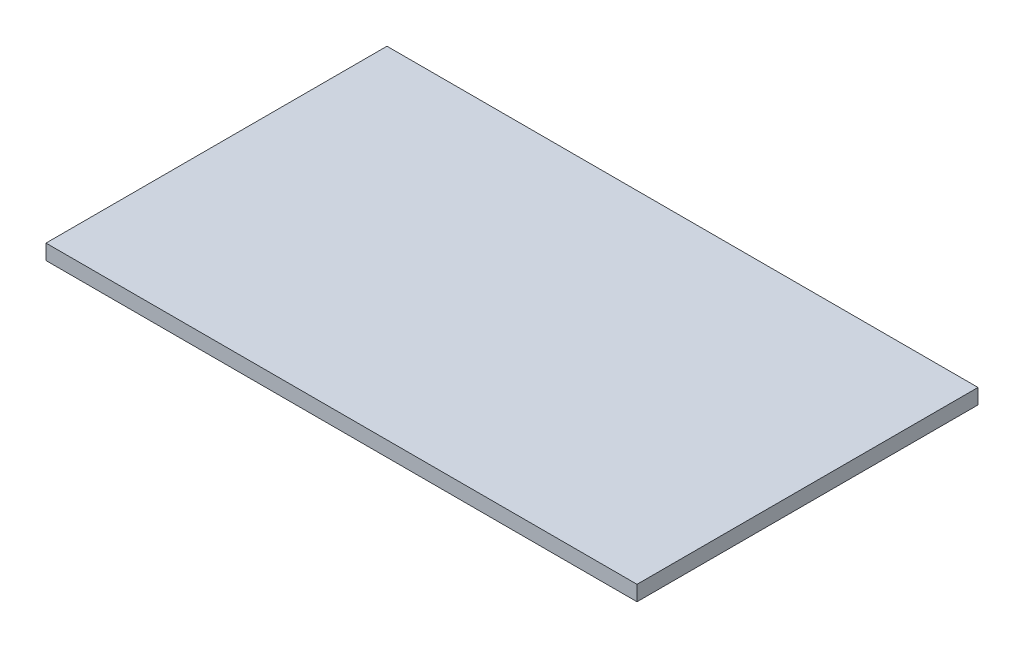
ISO-10303-21;
HEADER;
FILE_DESCRIPTION(('STEP AP214'),'2;1');
FILE_NAME('part.step','',(''),(''),'','','');
FILE_SCHEMA(('AUTOMOTIVE_DESIGN { 1 0 10303 214 1 1 1 1 }'));
ENDSEC;
DATA;
#1=APPLICATION_CONTEXT('core data for automotive mechanical design processes');
#2=APPLICATION_PROTOCOL_DEFINITION('international standard','automotive_design',2000,#1);
#3=PRODUCT_CONTEXT('',#1,'mechanical');
#4=PRODUCT('Part','Part','',(#3));
#5=PRODUCT_RELATED_PRODUCT_CATEGORY('part','',(#4));
#6=PRODUCT_DEFINITION_FORMATION('','',#4);
#7=PRODUCT_DEFINITION_CONTEXT('part definition',#1,'design');
#8=PRODUCT_DEFINITION('design','',#6,#7);
#9=PRODUCT_DEFINITION_SHAPE('','',#8);
#10=(LENGTH_UNIT() NAMED_UNIT(*) SI_UNIT(.MILLI.,.METRE.));
#11=(NAMED_UNIT(*) PLANE_ANGLE_UNIT() SI_UNIT($,.RADIAN.));
#12=(NAMED_UNIT(*) SI_UNIT($,.STERADIAN.) SOLID_ANGLE_UNIT());
#13=UNCERTAINTY_MEASURE_WITH_UNIT(LENGTH_MEASURE(1.E-05),#10,'distance_accuracy_value','');
#14=(GEOMETRIC_REPRESENTATION_CONTEXT(3) GLOBAL_UNCERTAINTY_ASSIGNED_CONTEXT((#13)) GLOBAL_UNIT_ASSIGNED_CONTEXT((#10,
#11,#12)) REPRESENTATION_CONTEXT('',''));
#15=CARTESIAN_POINT('',(0.,0.,0.));
#16=DIRECTION('',(0.,0.,1.));
#17=DIRECTION('',(1.,0.,0.));
#18=AXIS2_PLACEMENT_3D('',#15,#16,#17);
#19=CARTESIAN_POINT('',(-390.,20.,225.));
#20=DIRECTION('',(1.,0.,0.));
#21=DIRECTION('',(0.,0.,-1.));
#22=AXIS2_PLACEMENT_3D('',#19,#20,#21);
#23=PLANE('',#22);
#24=DIRECTION('',(0.,0.,1.));
#25=VECTOR('',#24,1.);
#26=CARTESIAN_POINT('',(-390.,0.,225.));
#27=LINE('',#26,#25);
#28=CARTESIAN_POINT('',(-390.,0.,-225.));
#29=VERTEX_POINT('',#28);
#30=CARTESIAN_POINT('',(-390.,0.,225.));
#31=VERTEX_POINT('',#30);
#32=EDGE_CURVE('E97',#29,#31,#27,.T.);
#33=ORIENTED_EDGE('',*,*,#32,.T.);
#34=DIRECTION('',(0.,-1.,0.));
#35=VECTOR('',#34,1.);
#36=CARTESIAN_POINT('',(-390.,20.,225.));
#37=LINE('',#36,#35);
#38=CARTESIAN_POINT('',(-390.,20.,225.));
#39=VERTEX_POINT('',#38);
#40=EDGE_CURVE('E11',#39,#31,#37,.T.);
#41=ORIENTED_EDGE('',*,*,#40,.F.);
#42=DIRECTION('',(0.,0.,1.));
#43=VECTOR('',#42,1.);
#44=CARTESIAN_POINT('',(-390.,20.,225.));
#45=LINE('',#44,#43);
#46=CARTESIAN_POINT('',(-390.,20.,-225.));
#47=VERTEX_POINT('',#46);
#48=EDGE_CURVE('E85',#47,#39,#45,.T.);
#49=ORIENTED_EDGE('',*,*,#48,.F.);
#50=DIRECTION('',(0.,-1.,0.));
#51=VECTOR('',#50,1.);
#52=CARTESIAN_POINT('',(-390.,20.,-225.));
#53=LINE('',#52,#51);
#54=EDGE_CURVE('E93',#47,#29,#53,.T.);
#55=ORIENTED_EDGE('',*,*,#54,.T.);
#56=EDGE_LOOP('',(#33,#41,#49,#55));
#57=FACE_BOUND('',#56,.T.);
#58=ADVANCED_FACE('F34',(#57),#23,.F.);
#59=CARTESIAN_POINT('',(390.,20.,225.));
#60=DIRECTION('',(0.,0.,-1.));
#61=DIRECTION('',(-1.,0.,0.));
#62=AXIS2_PLACEMENT_3D('',#59,#60,#61);
#63=PLANE('',#62);
#64=DIRECTION('',(1.,0.,0.));
#65=VECTOR('',#64,1.);
#66=CARTESIAN_POINT('',(390.,0.,225.));
#67=LINE('',#66,#65);
#68=CARTESIAN_POINT('',(390.,0.,225.));
#69=VERTEX_POINT('',#68);
#70=EDGE_CURVE('E89',#31,#69,#67,.T.);
#71=ORIENTED_EDGE('',*,*,#70,.T.);
#72=DIRECTION('',(0.,-1.,0.));
#73=VECTOR('',#72,1.);
#74=CARTESIAN_POINT('',(390.,20.,225.));
#75=LINE('',#74,#73);
#76=CARTESIAN_POINT('',(390.,20.,225.));
#77=VERTEX_POINT('',#76);
#78=EDGE_CURVE('E42',#77,#69,#75,.T.);
#79=ORIENTED_EDGE('',*,*,#78,.F.);
#80=DIRECTION('',(1.,0.,0.));
#81=VECTOR('',#80,1.);
#82=CARTESIAN_POINT('',(390.,20.,225.));
#83=LINE('',#82,#81);
#84=EDGE_CURVE('E80',#39,#77,#83,.T.);
#85=ORIENTED_EDGE('',*,*,#84,.F.);
#86=ORIENTED_EDGE('',*,*,#40,.T.);
#87=EDGE_LOOP('',(#71,#79,#85,#86));
#88=FACE_BOUND('',#87,.T.);
#89=ADVANCED_FACE('F88',(#88),#63,.F.);
#90=CARTESIAN_POINT('',(390.,20.,225.));
#91=DIRECTION('',(-1.,0.,0.));
#92=DIRECTION('',(0.,0.,1.));
#93=AXIS2_PLACEMENT_3D('',#90,#91,#92);
#94=PLANE('',#93);
#95=DIRECTION('',(0.,0.,-1.));
#96=VECTOR('',#95,1.);
#97=CARTESIAN_POINT('',(390.,0.,225.));
#98=LINE('',#97,#96);
#99=CARTESIAN_POINT('',(390.,0.,-225.));
#100=VERTEX_POINT('',#99);
#101=EDGE_CURVE('E67',#69,#100,#98,.T.);
#102=ORIENTED_EDGE('',*,*,#101,.T.);
#103=DIRECTION('',(0.,-1.,0.));
#104=VECTOR('',#103,1.);
#105=CARTESIAN_POINT('',(390.,20.,-225.));
#106=LINE('',#105,#104);
#107=CARTESIAN_POINT('',(390.,20.,-225.));
#108=VERTEX_POINT('',#107);
#109=EDGE_CURVE('E90',#108,#100,#106,.T.);
#110=ORIENTED_EDGE('',*,*,#109,.F.);
#111=DIRECTION('',(0.,0.,-1.));
#112=VECTOR('',#111,1.);
#113=CARTESIAN_POINT('',(390.,20.,225.));
#114=LINE('',#113,#112);
#115=EDGE_CURVE('E83',#77,#108,#114,.T.);
#116=ORIENTED_EDGE('',*,*,#115,.F.);
#117=ORIENTED_EDGE('',*,*,#78,.T.);
#118=EDGE_LOOP('',(#102,#110,#116,#117));
#119=FACE_BOUND('',#118,.T.);
#120=ADVANCED_FACE('F91',(#119),#94,.F.);
#121=CARTESIAN_POINT('',(390.,20.,-225.));
#122=DIRECTION('',(0.,0.,1.));
#123=DIRECTION('',(1.,0.,0.));
#124=AXIS2_PLACEMENT_3D('',#121,#122,#123);
#125=PLANE('',#124);
#126=DIRECTION('',(-1.,0.,0.));
#127=VECTOR('',#126,1.);
#128=CARTESIAN_POINT('',(390.,0.,-225.));
#129=LINE('',#128,#127);
#130=EDGE_CURVE('E73',#100,#29,#129,.T.);
#131=ORIENTED_EDGE('',*,*,#130,.T.);
#132=ORIENTED_EDGE('',*,*,#54,.F.);
#133=DIRECTION('',(-1.,0.,0.));
#134=VECTOR('',#133,1.);
#135=CARTESIAN_POINT('',(390.,20.,-225.));
#136=LINE('',#135,#134);
#137=EDGE_CURVE('E50',#108,#47,#136,.T.);
#138=ORIENTED_EDGE('',*,*,#137,.F.);
#139=ORIENTED_EDGE('',*,*,#109,.T.);
#140=EDGE_LOOP('',(#131,#132,#138,#139));
#141=FACE_BOUND('',#140,.T.);
#142=ADVANCED_FACE('F104',(#141),#125,.F.);
#143=CARTESIAN_POINT('',(0.,20.,0.));
#144=DIRECTION('',(0.,1.,0.));
#145=DIRECTION('',(0.,0.,1.));
#146=AXIS2_PLACEMENT_3D('',#143,#144,#145);
#147=PLANE('',#146);
#148=ORIENTED_EDGE('',*,*,#48,.T.);
#149=ORIENTED_EDGE('',*,*,#84,.T.);
#150=ORIENTED_EDGE('',*,*,#115,.T.);
#151=ORIENTED_EDGE('',*,*,#137,.T.);
#152=EDGE_LOOP('',(#148,#149,#150,#151));
#153=FACE_BOUND('',#152,.T.);
#154=ADVANCED_FACE('F81',(#153),#147,.T.);
#155=CARTESIAN_POINT('',(0.,0.,0.));
#156=DIRECTION('',(0.,1.,0.));
#157=DIRECTION('',(0.,0.,1.));
#158=AXIS2_PLACEMENT_3D('',#155,#156,#157);
#159=PLANE('',#158);
#160=ORIENTED_EDGE('',*,*,#32,.F.);
#161=ORIENTED_EDGE('',*,*,#130,.F.);
#162=ORIENTED_EDGE('',*,*,#101,.F.);
#163=ORIENTED_EDGE('',*,*,#70,.F.);
#164=EDGE_LOOP('',(#160,#161,#162,#163));
#165=FACE_BOUND('',#164,.T.);
#166=ADVANCED_FACE('F107',(#165),#159,.F.);
#167=CLOSED_SHELL('',(#58,#89,#120,#142,#154,#166));
#168=MANIFOLD_SOLID_BREP('B2',#167);
#169=ADVANCED_BREP_SHAPE_REPRESENTATION('',(#18,#168),#14);
#170=SHAPE_DEFINITION_REPRESENTATION(#9,#169);
ENDSEC;
END-ISO-10303-21;
